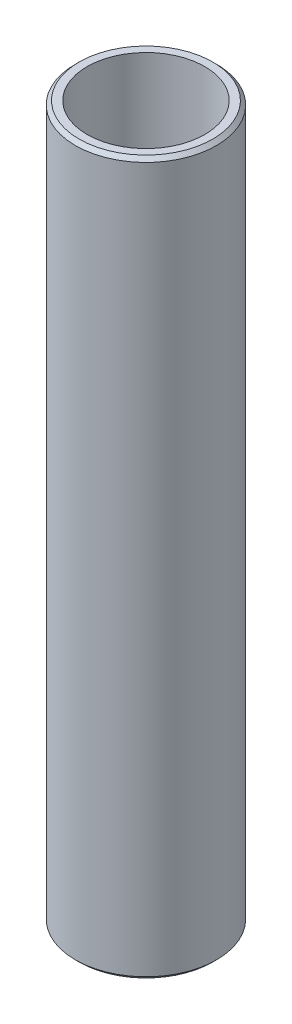
ISO-10303-21;
HEADER;
FILE_DESCRIPTION(('STEP AP214'),'2;1');
FILE_NAME('part.step','',(''),(''),'','','');
FILE_SCHEMA(('AUTOMOTIVE_DESIGN { 1 0 10303 214 1 1 1 1 }'));
ENDSEC;
DATA;
#1=APPLICATION_CONTEXT('core data for automotive mechanical design processes');
#2=APPLICATION_PROTOCOL_DEFINITION('international standard','automotive_design',2000,#1);
#3=PRODUCT_CONTEXT('',#1,'mechanical');
#4=PRODUCT('Part','Part','',(#3));
#5=PRODUCT_RELATED_PRODUCT_CATEGORY('part','',(#4));
#6=PRODUCT_DEFINITION_FORMATION('','',#4);
#7=PRODUCT_DEFINITION_CONTEXT('part definition',#1,'design');
#8=PRODUCT_DEFINITION('design','',#6,#7);
#9=PRODUCT_DEFINITION_SHAPE('','',#8);
#10=(LENGTH_UNIT() NAMED_UNIT(*) SI_UNIT(.MILLI.,.METRE.));
#11=(NAMED_UNIT(*) PLANE_ANGLE_UNIT() SI_UNIT($,.RADIAN.));
#12=(NAMED_UNIT(*) SI_UNIT($,.STERADIAN.) SOLID_ANGLE_UNIT());
#13=UNCERTAINTY_MEASURE_WITH_UNIT(LENGTH_MEASURE(1.E-05),#10,'distance_accuracy_value','');
#14=(GEOMETRIC_REPRESENTATION_CONTEXT(3) GLOBAL_UNCERTAINTY_ASSIGNED_CONTEXT((#13)) GLOBAL_UNIT_ASSIGNED_CONTEXT((#10,
#11,#12)) REPRESENTATION_CONTEXT('',''));
#15=CARTESIAN_POINT('',(0.,0.,0.));
#16=DIRECTION('',(0.,0.,1.));
#17=DIRECTION('',(1.,0.,0.));
#18=AXIS2_PLACEMENT_3D('',#15,#16,#17);
#19=CARTESIAN_POINT('',(0.,479.857106732866,0.));
#20=DIRECTION('',(0.,-1.,0.));
#21=DIRECTION('',(0.,0.,-1.));
#22=AXIS2_PLACEMENT_3D('',#19,#20,#21);
#23=CYLINDRICAL_SURFACE('',#22,47.5);
#24=CARTESIAN_POINT('',(0.,477.343727450511,0.));
#25=DIRECTION('',(0.,1.,0.));
#26=DIRECTION('',(0.,0.,1.));
#27=AXIS2_PLACEMENT_3D('',#24,#25,#26);
#28=CIRCLE('',#27,47.5);
#29=CARTESIAN_POINT('',(0.,477.343727450511,47.5));
#30=VERTEX_POINT('',#29);
#31=EDGE_CURVE('E50',#30,#30,#28,.F.);
#32=ORIENTED_EDGE('',*,*,#31,.T.);
#33=EDGE_LOOP('',(#32));
#34=FACE_BOUND('',#33,.T.);
#35=CARTESIAN_POINT('',(0.,2.51337928235479,0.));
#36=DIRECTION('',(0.,1.,0.));
#37=DIRECTION('',(0.,0.,1.));
#38=AXIS2_PLACEMENT_3D('',#35,#36,#37);
#39=CIRCLE('',#38,47.5);
#40=CARTESIAN_POINT('',(0.,2.51337928235479,47.5));
#41=VERTEX_POINT('',#40);
#42=EDGE_CURVE('E51',#41,#41,#39,.T.);
#43=ORIENTED_EDGE('',*,*,#42,.T.);
#44=EDGE_LOOP('',(#43));
#45=FACE_BOUND('',#44,.T.);
#46=ADVANCED_FACE('F39',(#34,#45),#23,.T.);
#47=CARTESIAN_POINT('',(0.,479.857106732866,0.));
#48=DIRECTION('',(0.,1.,0.));
#49=DIRECTION('',(0.,0.,1.));
#50=AXIS2_PLACEMENT_3D('',#47,#48,#49);
#51=PLANE('',#50);
#52=CARTESIAN_POINT('',(0.,479.857106732866,0.));
#53=DIRECTION('',(0.,1.,0.));
#54=DIRECTION('',(0.,0.,1.));
#55=AXIS2_PLACEMENT_3D('',#52,#53,#54);
#56=CIRCLE('',#55,44.9866207176451);
#57=CARTESIAN_POINT('',(0.,479.857106732866,44.9866207176451));
#58=VERTEX_POINT('',#57);
#59=EDGE_CURVE('E54',#58,#58,#56,.T.);
#60=ORIENTED_EDGE('',*,*,#59,.T.);
#61=EDGE_LOOP('',(#60));
#62=FACE_BOUND('',#61,.T.);
#63=CARTESIAN_POINT('',(0.,479.857106732866,0.));
#64=DIRECTION('',(0.,1.,0.));
#65=DIRECTION('',(0.,0.,1.));
#66=AXIS2_PLACEMENT_3D('',#63,#64,#65);
#67=CIRCLE('',#66,39.6368751499247);
#68=CARTESIAN_POINT('',(0.,479.857106732866,39.6368751499247));
#69=VERTEX_POINT('',#68);
#70=EDGE_CURVE('E58',#69,#69,#67,.T.);
#71=ORIENTED_EDGE('',*,*,#70,.F.);
#72=EDGE_LOOP('',(#71));
#73=FACE_BOUND('',#72,.T.);
#74=ADVANCED_FACE('F69',(#62,#73),#51,.T.);
#75=CARTESIAN_POINT('',(0.,0.,0.));
#76=DIRECTION('',(0.,1.,0.));
#77=DIRECTION('',(0.,0.,1.));
#78=AXIS2_PLACEMENT_3D('',#75,#76,#77);
#79=PLANE('',#78);
#80=CARTESIAN_POINT('',(0.,0.,0.));
#81=DIRECTION('',(0.,1.,0.));
#82=DIRECTION('',(0.,0.,1.));
#83=AXIS2_PLACEMENT_3D('',#80,#81,#82);
#84=CIRCLE('',#83,44.9866207176452);
#85=CARTESIAN_POINT('',(0.,0.,44.9866207176452));
#86=VERTEX_POINT('',#85);
#87=EDGE_CURVE('E10',#86,#86,#84,.F.);
#88=ORIENTED_EDGE('',*,*,#87,.T.);
#89=EDGE_LOOP('',(#88));
#90=FACE_BOUND('',#89,.T.);
#91=CARTESIAN_POINT('',(0.,0.,0.));
#92=DIRECTION('',(0.,1.,0.));
#93=DIRECTION('',(0.,0.,1.));
#94=AXIS2_PLACEMENT_3D('',#91,#92,#93);
#95=CIRCLE('',#94,39.6368751499247);
#96=CARTESIAN_POINT('',(0.,0.,39.6368751499247));
#97=VERTEX_POINT('',#96);
#98=EDGE_CURVE('E63',#97,#97,#95,.T.);
#99=ORIENTED_EDGE('',*,*,#98,.T.);
#100=EDGE_LOOP('',(#99));
#101=FACE_BOUND('',#100,.T.);
#102=ADVANCED_FACE('F75',(#90,#101),#79,.F.);
#103=CARTESIAN_POINT('',(0.,479.857106732866,0.));
#104=DIRECTION('',(0.,-1.,0.));
#105=DIRECTION('',(0.,0.,-1.));
#106=AXIS2_PLACEMENT_3D('',#103,#104,#105);
#107=CYLINDRICAL_SURFACE('',#106,39.6368751499247);
#108=ORIENTED_EDGE('',*,*,#70,.T.);
#109=EDGE_LOOP('',(#108));
#110=FACE_BOUND('',#109,.T.);
#111=ORIENTED_EDGE('',*,*,#98,.F.);
#112=EDGE_LOOP('',(#111));
#113=FACE_BOUND('',#112,.T.);
#114=ADVANCED_FACE('F70',(#110,#113),#107,.F.);
#115=CARTESIAN_POINT('',(0.,479.857106732866,0.));
#116=DIRECTION('',(0.,-1.,0.));
#117=DIRECTION('',(0.,0.,-1.));
#118=AXIS2_PLACEMENT_3D('',#115,#116,#117);
#119=CONICAL_SURFACE('',#118,44.9866207176451,0.785398163397463);
#120=ORIENTED_EDGE('',*,*,#31,.F.);
#121=EDGE_LOOP('',(#120));
#122=FACE_BOUND('',#121,.T.);
#123=ORIENTED_EDGE('',*,*,#59,.F.);
#124=EDGE_LOOP('',(#123));
#125=FACE_BOUND('',#124,.T.);
#126=ADVANCED_FACE('F81',(#122,#125),#119,.T.);
#127=CARTESIAN_POINT('',(0.,2.51337928235479,0.));
#128=DIRECTION('',(0.,1.,0.));
#129=DIRECTION('',(0.,0.,1.));
#130=AXIS2_PLACEMENT_3D('',#127,#128,#129);
#131=CONICAL_SURFACE('',#130,47.5,0.785398163397452);
#132=ORIENTED_EDGE('',*,*,#87,.F.);
#133=EDGE_LOOP('',(#132));
#134=FACE_BOUND('',#133,.T.);
#135=ORIENTED_EDGE('',*,*,#42,.F.);
#136=EDGE_LOOP('',(#135));
#137=FACE_BOUND('',#136,.T.);
#138=ADVANCED_FACE('F45',(#134,#137),#131,.T.);
#139=CLOSED_SHELL('',(#46,#74,#102,#114,#126,#138));
#140=MANIFOLD_SOLID_BREP('B2',#139);
#141=ADVANCED_BREP_SHAPE_REPRESENTATION('',(#18,#140),#14);
#142=SHAPE_DEFINITION_REPRESENTATION(#9,#141);
ENDSEC;
END-ISO-10303-21;
